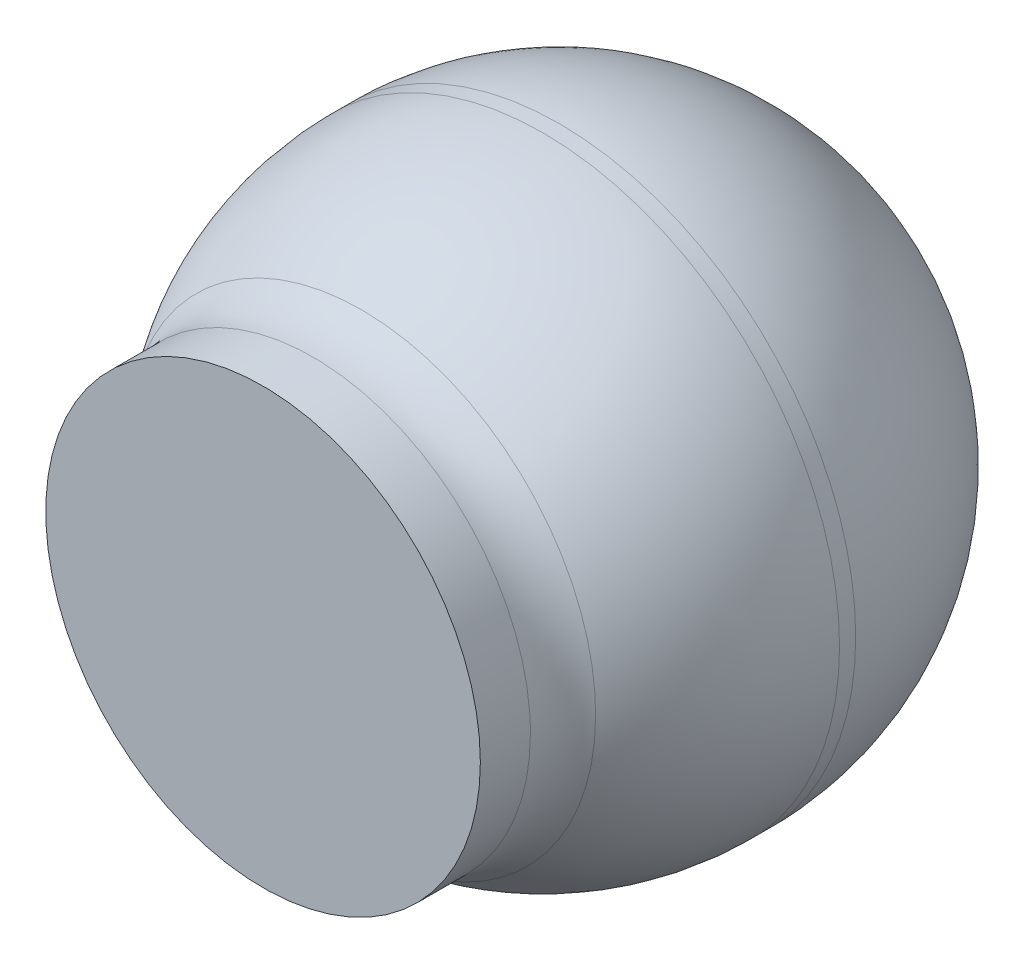
ISO-10303-21;
HEADER;
FILE_DESCRIPTION(('STEP AP214'),'2;1');
FILE_NAME('part.step','',(''),(''),'','','');
FILE_SCHEMA(('AUTOMOTIVE_DESIGN { 1 0 10303 214 1 1 1 1 }'));
ENDSEC;
DATA;
#1=APPLICATION_CONTEXT('core data for automotive mechanical design processes');
#2=APPLICATION_PROTOCOL_DEFINITION('international standard','automotive_design',2000,#1);
#3=PRODUCT_CONTEXT('',#1,'mechanical');
#4=PRODUCT('Part','Part','',(#3));
#5=PRODUCT_RELATED_PRODUCT_CATEGORY('part','',(#4));
#6=PRODUCT_DEFINITION_FORMATION('','',#4);
#7=PRODUCT_DEFINITION_CONTEXT('part definition',#1,'design');
#8=PRODUCT_DEFINITION('design','',#6,#7);
#9=PRODUCT_DEFINITION_SHAPE('','',#8);
#10=(LENGTH_UNIT() NAMED_UNIT(*) SI_UNIT(.MILLI.,.METRE.));
#11=(NAMED_UNIT(*) PLANE_ANGLE_UNIT() SI_UNIT($,.RADIAN.));
#12=(NAMED_UNIT(*) SI_UNIT($,.STERADIAN.) SOLID_ANGLE_UNIT());
#13=UNCERTAINTY_MEASURE_WITH_UNIT(LENGTH_MEASURE(1.E-05),#10,'distance_accuracy_value','');
#14=(GEOMETRIC_REPRESENTATION_CONTEXT(3) GLOBAL_UNCERTAINTY_ASSIGNED_CONTEXT((#13)) GLOBAL_UNIT_ASSIGNED_CONTEXT((#10,
#11,#12)) REPRESENTATION_CONTEXT('',''));
#15=CARTESIAN_POINT('',(0.,0.,0.));
#16=DIRECTION('',(0.,0.,1.));
#17=DIRECTION('',(1.,0.,0.));
#18=AXIS2_PLACEMENT_3D('',#15,#16,#17);
#19=CARTESIAN_POINT('',(-9.452919922269,-11.67134929145,10.006534503384));
#20=DIRECTION('',(0.,0.,-1.));
#21=DIRECTION('',(-1.,0.,0.));
#22=AXIS2_PLACEMENT_3D('',#19,#20,#21);
#23=PLANE('',#22);
#24=CARTESIAN_POINT('',(-9.452919922269,-11.67134929145,10.006534503384));
#25=DIRECTION('',(0.,0.,1.));
#26=DIRECTION('',(1.,0.,0.));
#27=AXIS2_PLACEMENT_3D('',#24,#25,#26);
#28=CIRCLE('',#27,0.275);
#29=CARTESIAN_POINT('',(-9.177919922269,-11.67134929145,10.006534503384));
#30=VERTEX_POINT('',#29);
#31=EDGE_CURVE('E20',#30,#30,#28,.F.);
#32=ORIENTED_EDGE('',*,*,#31,.F.);
#33=EDGE_LOOP('',(#32));
#34=FACE_BOUND('',#33,.T.);
#35=ADVANCED_FACE('F17',(#34),#23,.F.);
#36=CARTESIAN_POINT('',(-9.452919922269,-11.67134929145,9.906534503384));
#37=DIRECTION('',(0.,0.,1.));
#38=DIRECTION('',(1.,0.,0.));
#39=AXIS2_PLACEMENT_3D('',#36,#37,#38);
#40=CYLINDRICAL_SURFACE('',#39,0.275);
#41=CARTESIAN_POINT('',(-9.452919922269,-11.67134929145,9.943180457728));
#42=DIRECTION('',(0.,0.,-1.));
#43=DIRECTION('',(0.996700902337582,0.0811622527992467,0.));
#44=AXIS2_PLACEMENT_3D('',#41,#42,#43);
#45=CIRCLE('',#44,0.275000000000001);
#46=CARTESIAN_POINT('',(-9.17882717412617,-11.6490296719302,9.943180457728));
#47=VERTEX_POINT('',#46);
#48=EDGE_CURVE('E66',#47,#47,#45,.F.);
#49=ORIENTED_EDGE('',*,*,#48,.T.);
#50=EDGE_LOOP('',(#49));
#51=FACE_BOUND('',#50,.T.);
#52=ORIENTED_EDGE('',*,*,#31,.T.);
#53=EDGE_LOOP('',(#52));
#54=FACE_BOUND('',#53,.T.);
#55=ADVANCED_FACE('F62',(#51,#54),#40,.T.);
#56=CARTESIAN_POINT('',(-9.452919922269,-11.67134929145,9.943180457728));
#57=DIRECTION('',(0.,0.,-1.));
#58=DIRECTION('',(0.996700902337583,0.0811622527992448,0.));
#59=AXIS2_PLACEMENT_3D('',#56,#57,#58);
#60=TOROIDAL_SURFACE('',#59,0.375,0.1);
#61=ORIENTED_EDGE('',*,*,#48,.F.);
#62=EDGE_LOOP('',(#61));
#63=FACE_BOUND('',#62,.T.);
#64=CARTESIAN_POINT('',(-9.452919922269,-11.67134929145,9.881744931236));
#65=DIRECTION('',(0.,0.,-1.));
#66=DIRECTION('',(-0.996700902338691,-0.0811622527856359,0.));
#67=AXIS2_PLACEMENT_3D('',#64,#65,#66);
#68=CIRCLE('',#67,0.296097046412338);
#69=CARTESIAN_POINT('',(-9.748040115608,-11.69538119478,9.881744931236));
#70=VERTEX_POINT('',#69);
#71=EDGE_CURVE('E39',#70,#70,#68,.T.);
#72=ORIENTED_EDGE('',*,*,#71,.F.);
#73=EDGE_LOOP('',(#72));
#74=FACE_BOUND('',#73,.T.);
#75=ADVANCED_FACE('F57',(#63,#74),#60,.F.);
#76=CARTESIAN_POINT('',(-9.826682760645,-11.70178513625,9.651976062157));
#77=CARTESIAN_POINT('',(-9.826682760645,-11.70178513625,9.701461392103));
#78=CARTESIAN_POINT('',(-9.818526217348,-11.70112094157,9.750947004335));
#79=CARTESIAN_POINT('',(-9.802207085349,-11.69979205995,9.798626332798));
#80=CARTESIAN_POINT('',(-9.778341390838,-11.69784865493,9.842699544317));
#81=CARTESIAN_POINT('',(-9.748040115608,-11.69538119478,9.881744931236));
#82=(BOUNDED_CURVE() B_SPLINE_CURVE(5,(#76,#77,#78,#79,#80,#81),.UNSPECIFIED.,.F.,
.F.) B_SPLINE_CURVE_WITH_KNOTS((6,6),(0.,0.661568582165),
.UNSPECIFIED.) CURVE() GEOMETRIC_REPRESENTATION_ITEM() RATIONAL_B_SPLINE_CURVE((1.,1.,1.,1.,1.,1.)) REPRESENTATION_ITEM(''));
#83=CARTESIAN_POINT('',(-9.452919922269,-11.67134929145,9.651976062157));
#84=DIRECTION('',(0.,0.,-1.));
#85=AXIS1_PLACEMENT('',#83,#84);
#86=SURFACE_OF_REVOLUTION('',#82,#85);
#87=CARTESIAN_POINT('',(-9.452919922269,-11.67134929145,9.651976062157));
#88=DIRECTION('',(0.,0.,1.));
#89=DIRECTION('',(1.,0.,0.));
#90=AXIS2_PLACEMENT_3D('',#87,#88,#89);
#91=CIRCLE('',#90,0.375);
#92=CARTESIAN_POINT('',(-9.077919922269,-11.67134929145,9.651976062157));
#93=VERTEX_POINT('',#92);
#94=EDGE_CURVE('E36',#93,#93,#91,.F.);
#95=ORIENTED_EDGE('',*,*,#94,.F.);
#96=EDGE_LOOP('',(#95));
#97=FACE_BOUND('',#96,.T.);
#98=ORIENTED_EDGE('',*,*,#71,.T.);
#99=EDGE_LOOP('',(#98));
#100=FACE_BOUND('',#99,.T.);
#101=ADVANCED_FACE('F53',(#97,#100),#86,.F.);
#102=CARTESIAN_POINT('',(-9.452919922269,-11.67134929145,9.256534503384));
#103=DIRECTION('',(0.,0.,1.));
#104=DIRECTION('',(1.,0.,0.));
#105=AXIS2_PLACEMENT_3D('',#102,#103,#104);
#106=CYLINDRICAL_SURFACE('',#105,0.375);
#107=CARTESIAN_POINT('',(-9.452919922269,-11.67134929145,9.631534503384));
#108=DIRECTION('',(0.,0.,-1.));
#109=DIRECTION('',(0.0811622527992357,-0.996700902337583,0.));
#110=AXIS2_PLACEMENT_3D('',#107,#108,#109);
#111=CIRCLE('',#110,0.375);
#112=CARTESIAN_POINT('',(-9.42248407746929,-12.0451121298266,9.631534503384));
#113=VERTEX_POINT('',#112);
#114=CARTESIAN_POINT('',(-9.48335576706871,-11.2975864530734,9.631534503384));
#115=VERTEX_POINT('',#114);
#116=EDGE_CURVE('E11',#113,#115,#111,.T.);
#117=ORIENTED_EDGE('',*,*,#116,.F.);
#118=CARTESIAN_POINT('',(-9.452919922269,-11.67134929145,9.631534503384));
#119=DIRECTION('',(0.,0.,1.));
#120=DIRECTION('',(0.0811622527992365,-0.996700902337583,0.));
#121=AXIS2_PLACEMENT_3D('',#118,#119,#120);
#122=CIRCLE('',#121,0.375);
#123=EDGE_CURVE('E25',#115,#113,#122,.F.);
#124=ORIENTED_EDGE('',*,*,#123,.F.);
#125=EDGE_LOOP('',(#117,#124));
#126=FACE_BOUND('',#125,.T.);
#127=ORIENTED_EDGE('',*,*,#94,.T.);
#128=EDGE_LOOP('',(#127));
#129=FACE_BOUND('',#128,.T.);
#130=ADVANCED_FACE('F34',(#126,#129),#106,.T.);
#131=CARTESIAN_POINT('',(-9.452919922269,-11.67134929145,9.631534503384));
#132=DIRECTION('',(0.0811622527992361,-0.996700902337583,0.));
#133=DIRECTION('',(-0.996700902337583,-0.0811622527992361,0.));
#134=AXIS2_PLACEMENT_3D('',#131,#132,#133);
#135=SPHERICAL_SURFACE('',#134,0.375);
#136=ORIENTED_EDGE('',*,*,#123,.T.);
#137=ORIENTED_EDGE('',*,*,#116,.T.);
#138=EDGE_LOOP('',(#136,#137));
#139=FACE_BOUND('',#138,.T.);
#140=ADVANCED_FACE('F32',(#139),#135,.T.);
#141=CLOSED_SHELL('',(#35,#55,#75,#101,#130,#140));
#142=MANIFOLD_SOLID_BREP('B1',#141);
#143=ADVANCED_BREP_SHAPE_REPRESENTATION('',(#18,#142),#14);
#144=SHAPE_DEFINITION_REPRESENTATION(#9,#143);
ENDSEC;
END-ISO-10303-21;
